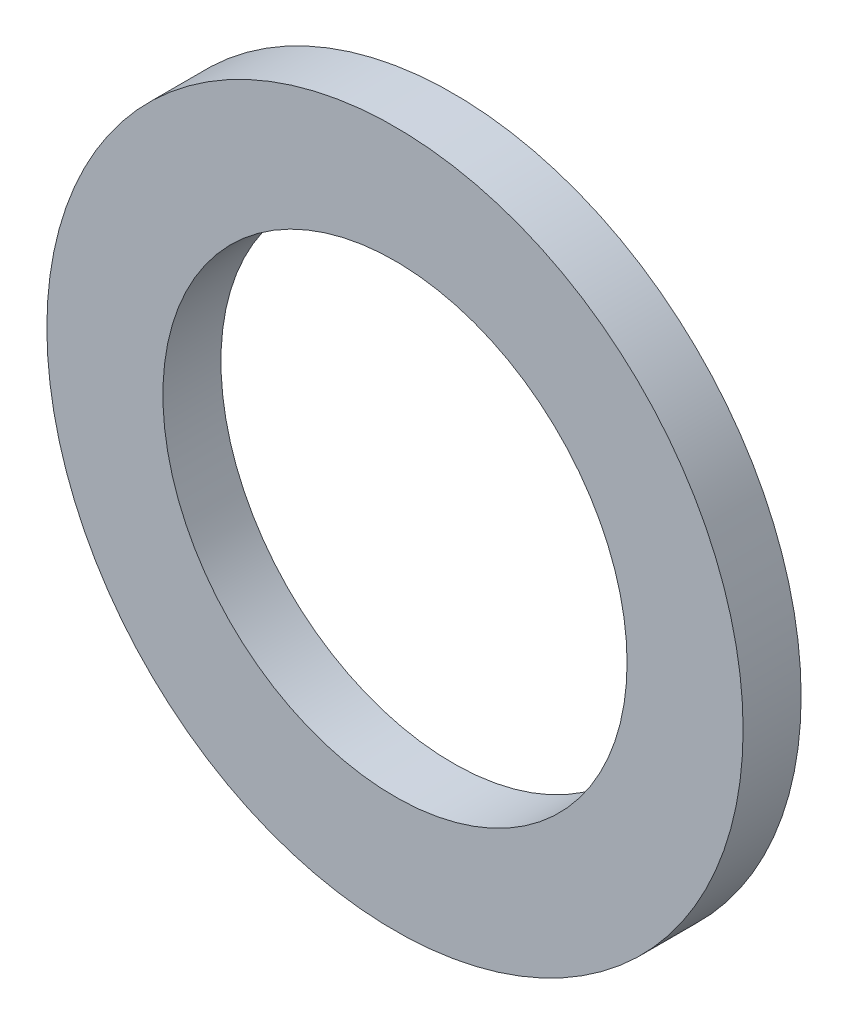
ISO-10303-21;
HEADER;
FILE_DESCRIPTION(('STEP AP214'),'2;1');
FILE_NAME('part.step','',(''),(''),'','','');
FILE_SCHEMA(('AUTOMOTIVE_DESIGN { 1 0 10303 214 1 1 1 1 }'));
ENDSEC;
DATA;
#1=APPLICATION_CONTEXT('core data for automotive mechanical design processes');
#2=APPLICATION_PROTOCOL_DEFINITION('international standard','automotive_design',2000,#1);
#3=PRODUCT_CONTEXT('',#1,'mechanical');
#4=PRODUCT('Part','Part','',(#3));
#5=PRODUCT_RELATED_PRODUCT_CATEGORY('part','',(#4));
#6=PRODUCT_DEFINITION_FORMATION('','',#4);
#7=PRODUCT_DEFINITION_CONTEXT('part definition',#1,'design');
#8=PRODUCT_DEFINITION('design','',#6,#7);
#9=PRODUCT_DEFINITION_SHAPE('','',#8);
#10=(LENGTH_UNIT() NAMED_UNIT(*) SI_UNIT(.MILLI.,.METRE.));
#11=(NAMED_UNIT(*) PLANE_ANGLE_UNIT() SI_UNIT($,.RADIAN.));
#12=(NAMED_UNIT(*) SI_UNIT($,.STERADIAN.) SOLID_ANGLE_UNIT());
#13=UNCERTAINTY_MEASURE_WITH_UNIT(LENGTH_MEASURE(1.E-05),#10,'distance_accuracy_value','');
#14=(GEOMETRIC_REPRESENTATION_CONTEXT(3) GLOBAL_UNCERTAINTY_ASSIGNED_CONTEXT((#13)) GLOBAL_UNIT_ASSIGNED_CONTEXT((#10,
#11,#12)) REPRESENTATION_CONTEXT('',''));
#15=CARTESIAN_POINT('',(0.,0.,0.));
#16=DIRECTION('',(0.,0.,1.));
#17=DIRECTION('',(1.,0.,0.));
#18=AXIS2_PLACEMENT_3D('',#15,#16,#17);
#19=CARTESIAN_POINT('',(0.,0.,1.));
#20=DIRECTION('',(0.,0.,1.));
#21=DIRECTION('',(1.,0.,0.));
#22=AXIS2_PLACEMENT_3D('',#19,#20,#21);
#23=PLANE('',#22);
#24=CARTESIAN_POINT('',(0.,0.,1.));
#25=DIRECTION('',(0.,0.,1.));
#26=DIRECTION('',(1.,0.,0.));
#27=AXIS2_PLACEMENT_3D('',#24,#25,#26);
#28=CIRCLE('',#27,6.);
#29=CARTESIAN_POINT('',(6.,0.,1.));
#30=VERTEX_POINT('',#29);
#31=EDGE_CURVE('E10',#30,#30,#28,.T.);
#32=ORIENTED_EDGE('',*,*,#31,.T.);
#33=EDGE_LOOP('',(#32));
#34=FACE_BOUND('',#33,.T.);
#35=CARTESIAN_POINT('',(0.,0.,1.));
#36=DIRECTION('',(0.,0.,1.));
#37=DIRECTION('',(1.,0.,0.));
#38=AXIS2_PLACEMENT_3D('',#35,#36,#37);
#39=CIRCLE('',#38,4.);
#40=CARTESIAN_POINT('',(4.,0.,1.));
#41=VERTEX_POINT('',#40);
#42=EDGE_CURVE('E40',#41,#41,#39,.T.);
#43=ORIENTED_EDGE('',*,*,#42,.F.);
#44=EDGE_LOOP('',(#43));
#45=FACE_BOUND('',#44,.T.);
#46=ADVANCED_FACE('F29',(#34,#45),#23,.T.);
#47=CARTESIAN_POINT('',(0.,0.,0.));
#48=DIRECTION('',(0.,0.,1.));
#49=DIRECTION('',(1.,0.,0.));
#50=AXIS2_PLACEMENT_3D('',#47,#48,#49);
#51=PLANE('',#50);
#52=CARTESIAN_POINT('',(0.,0.,0.));
#53=DIRECTION('',(0.,0.,1.));
#54=DIRECTION('',(1.,0.,0.));
#55=AXIS2_PLACEMENT_3D('',#52,#53,#54);
#56=CIRCLE('',#55,6.);
#57=CARTESIAN_POINT('',(6.,0.,0.));
#58=VERTEX_POINT('',#57);
#59=EDGE_CURVE('E33',#58,#58,#56,.T.);
#60=ORIENTED_EDGE('',*,*,#59,.F.);
#61=EDGE_LOOP('',(#60));
#62=FACE_BOUND('',#61,.T.);
#63=CARTESIAN_POINT('',(0.,0.,0.));
#64=DIRECTION('',(0.,0.,1.));
#65=DIRECTION('',(1.,0.,0.));
#66=AXIS2_PLACEMENT_3D('',#63,#64,#65);
#67=CIRCLE('',#66,4.);
#68=CARTESIAN_POINT('',(4.,0.,0.));
#69=VERTEX_POINT('',#68);
#70=EDGE_CURVE('E42',#69,#69,#67,.T.);
#71=ORIENTED_EDGE('',*,*,#70,.T.);
#72=EDGE_LOOP('',(#71));
#73=FACE_BOUND('',#72,.T.);
#74=ADVANCED_FACE('F52',(#62,#73),#51,.F.);
#75=CARTESIAN_POINT('',(0.,0.,1.));
#76=DIRECTION('',(0.,0.,-1.));
#77=DIRECTION('',(-1.,0.,0.));
#78=AXIS2_PLACEMENT_3D('',#75,#76,#77);
#79=CYLINDRICAL_SURFACE('',#78,6.);
#80=ORIENTED_EDGE('',*,*,#31,.F.);
#81=EDGE_LOOP('',(#80));
#82=FACE_BOUND('',#81,.T.);
#83=ORIENTED_EDGE('',*,*,#59,.T.);
#84=EDGE_LOOP('',(#83));
#85=FACE_BOUND('',#84,.T.);
#86=ADVANCED_FACE('F31',(#82,#85),#79,.T.);
#87=CARTESIAN_POINT('',(0.,0.,1.));
#88=DIRECTION('',(0.,0.,-1.));
#89=DIRECTION('',(-1.,0.,0.));
#90=AXIS2_PLACEMENT_3D('',#87,#88,#89);
#91=CYLINDRICAL_SURFACE('',#90,4.);
#92=ORIENTED_EDGE('',*,*,#42,.T.);
#93=EDGE_LOOP('',(#92));
#94=FACE_BOUND('',#93,.T.);
#95=ORIENTED_EDGE('',*,*,#70,.F.);
#96=EDGE_LOOP('',(#95));
#97=FACE_BOUND('',#96,.T.);
#98=ADVANCED_FACE('F48',(#94,#97),#91,.F.);
#99=CLOSED_SHELL('',(#46,#74,#86,#98));
#100=MANIFOLD_SOLID_BREP('B2',#99);
#101=ADVANCED_BREP_SHAPE_REPRESENTATION('',(#18,#100),#14);
#102=SHAPE_DEFINITION_REPRESENTATION(#9,#101);
ENDSEC;
END-ISO-10303-21;
